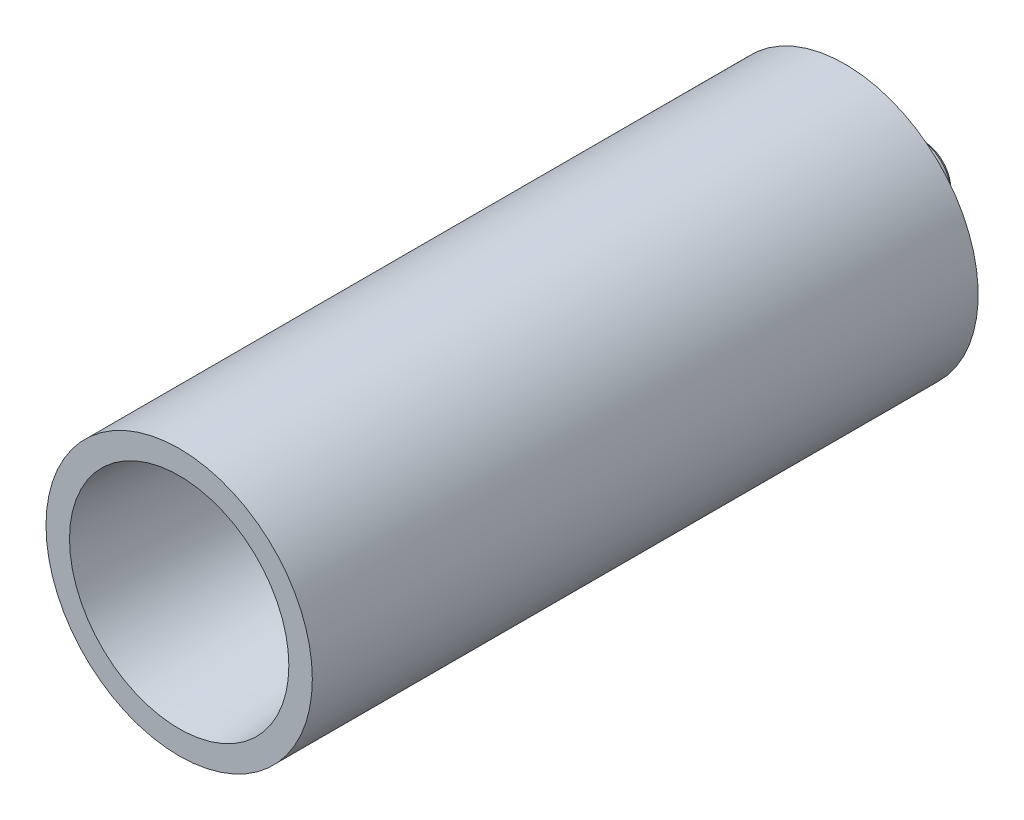
ISO-10303-21;
HEADER;
FILE_DESCRIPTION(('STEP AP214'),'2;1');
FILE_NAME('part.step','',(''),(''),'','','');
FILE_SCHEMA(('AUTOMOTIVE_DESIGN { 1 0 10303 214 1 1 1 1 }'));
ENDSEC;
DATA;
#1=APPLICATION_CONTEXT('core data for automotive mechanical design processes');
#2=APPLICATION_PROTOCOL_DEFINITION('international standard','automotive_design',2000,#1);
#3=PRODUCT_CONTEXT('',#1,'mechanical');
#4=PRODUCT('Part','Part','',(#3));
#5=PRODUCT_RELATED_PRODUCT_CATEGORY('part','',(#4));
#6=PRODUCT_DEFINITION_FORMATION('','',#4);
#7=PRODUCT_DEFINITION_CONTEXT('part definition',#1,'design');
#8=PRODUCT_DEFINITION('design','',#6,#7);
#9=PRODUCT_DEFINITION_SHAPE('','',#8);
#10=(LENGTH_UNIT() NAMED_UNIT(*) SI_UNIT(.MILLI.,.METRE.));
#11=(NAMED_UNIT(*) PLANE_ANGLE_UNIT() SI_UNIT($,.RADIAN.));
#12=(NAMED_UNIT(*) SI_UNIT($,.STERADIAN.) SOLID_ANGLE_UNIT());
#13=UNCERTAINTY_MEASURE_WITH_UNIT(LENGTH_MEASURE(1.E-05),#10,'distance_accuracy_value','');
#14=(GEOMETRIC_REPRESENTATION_CONTEXT(3) GLOBAL_UNCERTAINTY_ASSIGNED_CONTEXT((#13)) GLOBAL_UNIT_ASSIGNED_CONTEXT((#10,
#11,#12)) REPRESENTATION_CONTEXT('',''));
#15=CARTESIAN_POINT('',(0.,0.,0.));
#16=DIRECTION('',(0.,0.,1.));
#17=DIRECTION('',(1.,0.,0.));
#18=AXIS2_PLACEMENT_3D('',#15,#16,#17);
#19=CARTESIAN_POINT('',(0.,0.,80.));
#20=DIRECTION('',(0.,0.,1.));
#21=DIRECTION('',(1.,0.,0.));
#22=AXIS2_PLACEMENT_3D('',#19,#20,#21);
#23=PLANE('',#22);
#24=CARTESIAN_POINT('',(0.,0.,80.));
#25=DIRECTION('',(0.,0.,1.));
#26=DIRECTION('',(1.,0.,0.));
#27=AXIS2_PLACEMENT_3D('',#24,#25,#26);
#28=CIRCLE('',#27,14.);
#29=CARTESIAN_POINT('',(14.,0.,80.));
#30=VERTEX_POINT('',#29);
#31=EDGE_CURVE('E67',#30,#30,#28,.F.);
#32=ORIENTED_EDGE('',*,*,#31,.T.);
#33=EDGE_LOOP('',(#32));
#34=FACE_BOUND('',#33,.T.);
#35=CARTESIAN_POINT('',(0.,0.,80.));
#36=DIRECTION('',(0.,0.,1.));
#37=DIRECTION('',(1.,0.,0.));
#38=AXIS2_PLACEMENT_3D('',#35,#36,#37);
#39=CIRCLE('',#38,17.);
#40=CARTESIAN_POINT('',(17.,0.,80.));
#41=VERTEX_POINT('',#40);
#42=EDGE_CURVE('E75',#41,#41,#39,.T.);
#43=ORIENTED_EDGE('',*,*,#42,.T.);
#44=EDGE_LOOP('',(#43));
#45=FACE_BOUND('',#44,.T.);
#46=ADVANCED_FACE('F45',(#34,#45),#23,.T.);
#47=CARTESIAN_POINT('',(0.,0.,80.));
#48=DIRECTION('',(0.,0.,-1.));
#49=DIRECTION('',(-1.,0.,0.));
#50=AXIS2_PLACEMENT_3D('',#47,#48,#49);
#51=CYLINDRICAL_SURFACE('',#50,17.);
#52=ORIENTED_EDGE('',*,*,#42,.F.);
#53=EDGE_LOOP('',(#52));
#54=FACE_BOUND('',#53,.T.);
#55=CARTESIAN_POINT('',(0.,0.,-5.));
#56=DIRECTION('',(0.,0.,-1.));
#57=DIRECTION('',(-1.,0.,0.));
#58=AXIS2_PLACEMENT_3D('',#55,#56,#57);
#59=CIRCLE('',#58,17.);
#60=CARTESIAN_POINT('',(-17.,0.,-5.));
#61=VERTEX_POINT('',#60);
#62=EDGE_CURVE('E83',#61,#61,#59,.T.);
#63=ORIENTED_EDGE('',*,*,#62,.F.);
#64=EDGE_LOOP('',(#63));
#65=FACE_BOUND('',#64,.T.);
#66=ADVANCED_FACE('F117',(#54,#65),#51,.T.);
#67=CARTESIAN_POINT('',(0.,0.,80.));
#68=DIRECTION('',(0.,0.,-1.));
#69=DIRECTION('',(-1.,0.,0.));
#70=AXIS2_PLACEMENT_3D('',#67,#68,#69);
#71=CYLINDRICAL_SURFACE('',#70,12.);
#72=CARTESIAN_POINT('',(0.,0.,57.1398953944783));
#73=DIRECTION('',(0.,0.,1.));
#74=DIRECTION('',(1.,0.,0.));
#75=AXIS2_PLACEMENT_3D('',#72,#73,#74);
#76=CIRCLE('',#75,12.);
#77=CARTESIAN_POINT('',(12.,0.,57.1398953944783));
#78=VERTEX_POINT('',#77);
#79=EDGE_CURVE('E71',#78,#78,#76,.T.);
#80=ORIENTED_EDGE('',*,*,#79,.T.);
#81=EDGE_LOOP('',(#80));
#82=FACE_BOUND('',#81,.T.);
#83=CARTESIAN_POINT('',(0.,0.,0.));
#84=DIRECTION('',(0.,0.,1.));
#85=DIRECTION('',(1.,0.,0.));
#86=AXIS2_PLACEMENT_3D('',#83,#84,#85);
#87=CIRCLE('',#86,12.);
#88=CARTESIAN_POINT('',(12.,0.,0.));
#89=VERTEX_POINT('',#88);
#90=EDGE_CURVE('E79',#89,#89,#87,.T.);
#91=ORIENTED_EDGE('',*,*,#90,.F.);
#92=EDGE_LOOP('',(#91));
#93=FACE_BOUND('',#92,.T.);
#94=ADVANCED_FACE('F123',(#82,#93),#71,.F.);
#95=CARTESIAN_POINT('',(0.,0.,57.1398953944783));
#96=DIRECTION('',(0.,0.,1.));
#97=DIRECTION('',(1.,0.,0.));
#98=AXIS2_PLACEMENT_3D('',#95,#96,#97);
#99=CONICAL_SURFACE('',#98,12.,0.0872664625997203);
#100=ORIENTED_EDGE('',*,*,#31,.F.);
#101=EDGE_LOOP('',(#100));
#102=FACE_BOUND('',#101,.T.);
#103=ORIENTED_EDGE('',*,*,#79,.F.);
#104=EDGE_LOOP('',(#103));
#105=FACE_BOUND('',#104,.T.);
#106=ADVANCED_FACE('F130',(#102,#105),#99,.F.);
#107=CARTESIAN_POINT('',(0.,0.,0.));
#108=DIRECTION('',(0.,0.,-1.));
#109=DIRECTION('',(-1.,0.,0.));
#110=AXIS2_PLACEMENT_3D('',#107,#108,#109);
#111=PLANE('',#110);
#112=ORIENTED_EDGE('',*,*,#90,.T.);
#113=EDGE_LOOP('',(#112));
#114=FACE_BOUND('',#113,.T.);
#115=ADVANCED_FACE('F134',(#114),#111,.F.);
#116=CARTESIAN_POINT('',(0.,0.,-5.));
#117=DIRECTION('',(0.,0.,-1.));
#118=DIRECTION('',(-1.,0.,0.));
#119=AXIS2_PLACEMENT_3D('',#116,#117,#118);
#120=PLANE('',#119);
#121=CARTESIAN_POINT('',(0.,0.,-5.));
#122=DIRECTION('',(0.,0.,-1.));
#123=DIRECTION('',(-1.,0.,0.));
#124=AXIS2_PLACEMENT_3D('',#121,#122,#123);
#125=CIRCLE('',#124,16.9372539331938);
#126=CARTESIAN_POINT('',(-16.9372539331938,0.,-5.));
#127=VERTEX_POINT('',#126);
#128=EDGE_CURVE('E59',#127,#127,#125,.F.);
#129=ORIENTED_EDGE('',*,*,#128,.T.);
#130=EDGE_LOOP('',(#129));
#131=FACE_BOUND('',#130,.T.);
#132=ORIENTED_EDGE('',*,*,#62,.T.);
#133=EDGE_LOOP('',(#132));
#134=FACE_BOUND('',#133,.T.);
#135=ADVANCED_FACE('F100',(#131,#134),#120,.T.);
#136=CARTESIAN_POINT('',(0.,0.,-8.));
#137=DIRECTION('',(0.,0.,-1.));
#138=DIRECTION('',(-1.,0.,0.));
#139=AXIS2_PLACEMENT_3D('',#136,#137,#138);
#140=PLANE('',#139);
#141=CARTESIAN_POINT('',(0.,0.,-8.));
#142=DIRECTION('',(0.,0.,-1.));
#143=DIRECTION('',(-1.,0.,0.));
#144=AXIS2_PLACEMENT_3D('',#141,#142,#143);
#145=CIRCLE('',#144,4.);
#146=CARTESIAN_POINT('',(-4.,0.,-8.));
#147=VERTEX_POINT('',#146);
#148=EDGE_CURVE('E64',#147,#147,#145,.T.);
#149=ORIENTED_EDGE('',*,*,#148,.F.);
#150=EDGE_LOOP('',(#149));
#151=FACE_BOUND('',#150,.T.);
#152=CARTESIAN_POINT('',(0.,0.,-8.));
#153=DIRECTION('',(0.,0.,-1.));
#154=DIRECTION('',(-1.,0.,0.));
#155=AXIS2_PLACEMENT_3D('',#152,#153,#154);
#156=CIRCLE('',#155,9.);
#157=CARTESIAN_POINT('',(-9.,0.,-8.));
#158=VERTEX_POINT('',#157);
#159=EDGE_CURVE('E87',#158,#158,#156,.T.);
#160=ORIENTED_EDGE('',*,*,#159,.T.);
#161=EDGE_LOOP('',(#160));
#162=FACE_BOUND('',#161,.T.);
#163=ADVANCED_FACE('F97',(#151,#162),#140,.T.);
#164=CARTESIAN_POINT('',(0.,0.,-15.));
#165=DIRECTION('',(0.,0.,1.));
#166=DIRECTION('',(1.,0.,0.));
#167=AXIS2_PLACEMENT_3D('',#164,#165,#166);
#168=CYLINDRICAL_SURFACE('',#167,4.);
#169=CARTESIAN_POINT('',(0.,0.,-14.5));
#170=DIRECTION('',(0.,0.,-1.));
#171=DIRECTION('',(-1.,0.,0.));
#172=AXIS2_PLACEMENT_3D('',#169,#170,#171);
#173=CIRCLE('',#172,4.);
#174=CARTESIAN_POINT('',(-4.,0.,-14.5));
#175=VERTEX_POINT('',#174);
#176=EDGE_CURVE('E10',#175,#175,#173,.F.);
#177=ORIENTED_EDGE('',*,*,#176,.T.);
#178=EDGE_LOOP('',(#177));
#179=FACE_BOUND('',#178,.T.);
#180=ORIENTED_EDGE('',*,*,#148,.T.);
#181=EDGE_LOOP('',(#180));
#182=FACE_BOUND('',#181,.T.);
#183=ADVANCED_FACE('F95',(#179,#182),#168,.T.);
#184=CARTESIAN_POINT('',(0.,0.,-15.));
#185=DIRECTION('',(0.,0.,-1.));
#186=DIRECTION('',(-1.,0.,0.));
#187=AXIS2_PLACEMENT_3D('',#184,#185,#186);
#188=PLANE('',#187);
#189=CARTESIAN_POINT('',(0.,0.,-15.));
#190=DIRECTION('',(0.,0.,-1.));
#191=DIRECTION('',(-1.,0.,0.));
#192=AXIS2_PLACEMENT_3D('',#189,#190,#191);
#193=CIRCLE('',#192,3.5);
#194=CARTESIAN_POINT('',(-3.5,0.,-15.));
#195=VERTEX_POINT('',#194);
#196=EDGE_CURVE('E54',#195,#195,#193,.T.);
#197=ORIENTED_EDGE('',*,*,#196,.T.);
#198=EDGE_LOOP('',(#197));
#199=FACE_BOUND('',#198,.T.);
#200=ADVANCED_FACE('F106',(#199),#188,.T.);
#201=CARTESIAN_POINT('',(0.,0.,-17.));
#202=DIRECTION('',(0.,0.,-1.));
#203=DIRECTION('',(-1.,0.,0.));
#204=AXIS2_PLACEMENT_3D('',#201,#202,#203);
#205=TOROIDAL_SURFACE('',#204,16.9372539331938,12.);
#206=ORIENTED_EDGE('',*,*,#128,.F.);
#207=EDGE_LOOP('',(#206));
#208=FACE_BOUND('',#207,.T.);
#209=ORIENTED_EDGE('',*,*,#159,.F.);
#210=EDGE_LOOP('',(#209));
#211=FACE_BOUND('',#210,.T.);
#212=ADVANCED_FACE('F104',(#208,#211),#205,.F.);
#213=CARTESIAN_POINT('',(0.,0.,-15.));
#214=DIRECTION('',(0.,0.,1.));
#215=DIRECTION('',(1.,0.,0.));
#216=AXIS2_PLACEMENT_3D('',#213,#214,#215);
#217=CONICAL_SURFACE('',#216,3.5,0.785398163397448);
#218=ORIENTED_EDGE('',*,*,#176,.F.);
#219=EDGE_LOOP('',(#218));
#220=FACE_BOUND('',#219,.T.);
#221=ORIENTED_EDGE('',*,*,#196,.F.);
#222=EDGE_LOOP('',(#221));
#223=FACE_BOUND('',#222,.T.);
#224=ADVANCED_FACE('F48',(#220,#223),#217,.T.);
#225=CLOSED_SHELL('',(#46,#66,#94,#106,#115,#135,#163,#183,#200,#212,#224));
#226=MANIFOLD_SOLID_BREP('B2',#225);
#227=ADVANCED_BREP_SHAPE_REPRESENTATION('',(#18,#226),#14);
#228=SHAPE_DEFINITION_REPRESENTATION(#9,#227);
ENDSEC;
END-ISO-10303-21;
